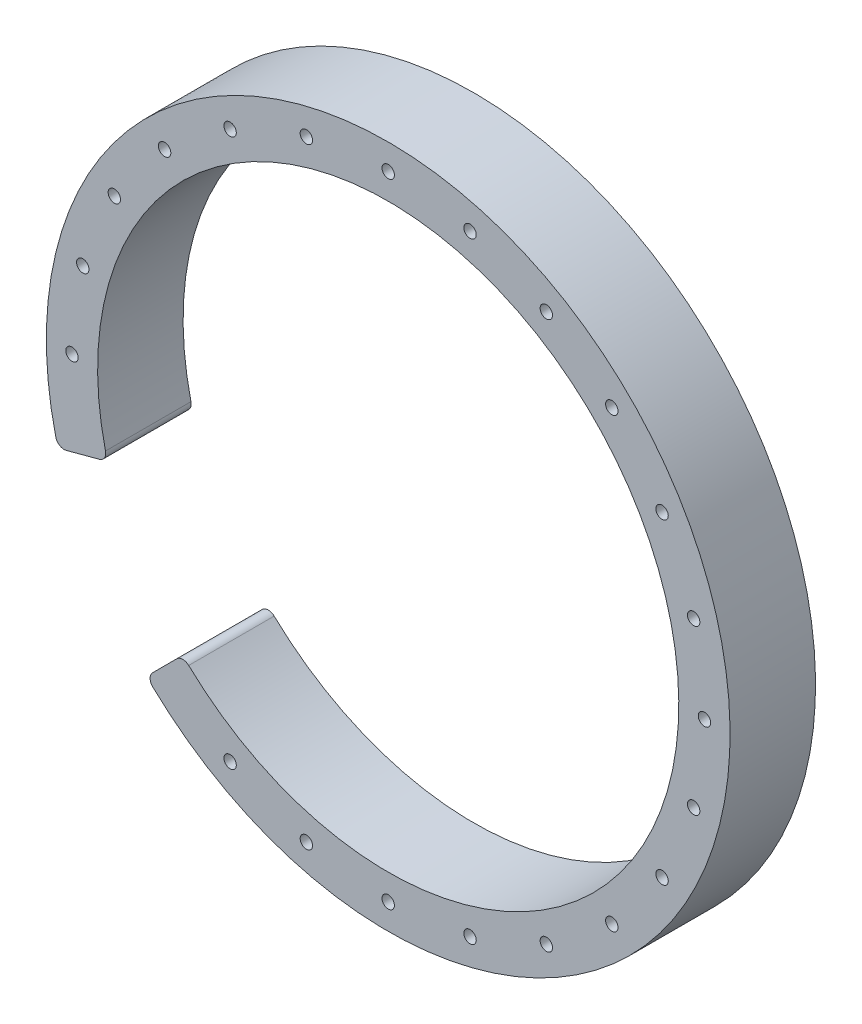
ISO-10303-21;
HEADER;
FILE_DESCRIPTION(('STEP AP214'),'2;1');
FILE_NAME('part.step','',(''),(''),'','','');
FILE_SCHEMA(('AUTOMOTIVE_DESIGN { 1 0 10303 214 1 1 1 1 }'));
ENDSEC;
DATA;
#1=APPLICATION_CONTEXT('core data for automotive mechanical design processes');
#2=APPLICATION_PROTOCOL_DEFINITION('international standard','automotive_design',2000,#1);
#3=PRODUCT_CONTEXT('',#1,'mechanical');
#4=PRODUCT('Part','Part','',(#3));
#5=PRODUCT_RELATED_PRODUCT_CATEGORY('part','',(#4));
#6=PRODUCT_DEFINITION_FORMATION('','',#4);
#7=PRODUCT_DEFINITION_CONTEXT('part definition',#1,'design');
#8=PRODUCT_DEFINITION('design','',#6,#7);
#9=PRODUCT_DEFINITION_SHAPE('','',#8);
#10=(LENGTH_UNIT() NAMED_UNIT(*) SI_UNIT(.MILLI.,.METRE.));
#11=(NAMED_UNIT(*) PLANE_ANGLE_UNIT() SI_UNIT($,.RADIAN.));
#12=(NAMED_UNIT(*) SI_UNIT($,.STERADIAN.) SOLID_ANGLE_UNIT());
#13=UNCERTAINTY_MEASURE_WITH_UNIT(LENGTH_MEASURE(1.E-05),#10,'distance_accuracy_value','');
#14=(GEOMETRIC_REPRESENTATION_CONTEXT(3) GLOBAL_UNCERTAINTY_ASSIGNED_CONTEXT((#13)) GLOBAL_UNIT_ASSIGNED_CONTEXT((#10,
#11,#12)) REPRESENTATION_CONTEXT('',''));
#15=CARTESIAN_POINT('',(0.,0.,0.));
#16=DIRECTION('',(0.,0.,1.));
#17=DIRECTION('',(1.,0.,0.));
#18=AXIS2_PLACEMENT_3D('',#15,#16,#17);
#19=CARTESIAN_POINT('',(-31.1879680337444,-2.03767962998269,20.));
#20=DIRECTION('',(0.,0.,-1.));
#21=DIRECTION('',(-1.,0.,0.));
#22=AXIS2_PLACEMENT_3D('',#19,#20,#21);
#23=PLANE('',#22);
#24=CARTESIAN_POINT('',(116.125624252993,35.3643260960563,20.));
#25=DIRECTION('',(0.,0.,1.));
#26=DIRECTION('',(1.,0.,0.));
#27=AXIS2_PLACEMENT_3D('',#24,#25,#26);
#28=CIRCLE('',#27,1.45000000068002);
#29=CARTESIAN_POINT('',(117.575624253673,35.3643260960563,20.));
#30=VERTEX_POINT('',#29);
#31=EDGE_CURVE('E290',#30,#30,#28,.T.);
#32=ORIENTED_EDGE('',*,*,#31,.F.);
#33=EDGE_LOOP('',(#32));
#34=FACE_BOUND('',#33,.T.);
#35=CARTESIAN_POINT('',(96.9730149154132,68.5376185656963,20.));
#36=DIRECTION('',(0.,0.,1.));
#37=DIRECTION('',(1.,0.,0.));
#38=AXIS2_PLACEMENT_3D('',#35,#36,#37);
#39=CIRCLE('',#38,1.45000000068002);
#40=CARTESIAN_POINT('',(98.4230149160933,68.5376185656963,20.));
#41=VERTEX_POINT('',#40);
#42=EDGE_CURVE('E278',#41,#41,#39,.T.);
#43=ORIENTED_EDGE('',*,*,#42,.F.);
#44=EDGE_LOOP('',(#43));
#45=FACE_BOUND('',#44,.T.);
#46=CARTESIAN_POINT('',(63.7997224432332,87.6902279032763,20.));
#47=DIRECTION('',(0.,0.,1.));
#48=DIRECTION('',(1.,0.,0.));
#49=AXIS2_PLACEMENT_3D('',#46,#47,#48);
#50=CIRCLE('',#49,1.45000000068002);
#51=CARTESIAN_POINT('',(65.2497224439132,87.6902279032763,20.));
#52=VERTEX_POINT('',#51);
#53=EDGE_CURVE('E266',#52,#52,#50,.T.);
#54=ORIENTED_EDGE('',*,*,#53,.F.);
#55=EDGE_LOOP('',(#54));
#56=FACE_BOUND('',#55,.T.);
#57=CARTESIAN_POINT('',(25.4945037680733,87.6902279032763,20.));
#58=DIRECTION('',(0.,0.,1.));
#59=DIRECTION('',(1.,0.,0.));
#60=AXIS2_PLACEMENT_3D('',#57,#58,#59);
#61=CIRCLE('',#60,1.45000000067999);
#62=CARTESIAN_POINT('',(26.9445037687533,87.6902279032763,20.));
#63=VERTEX_POINT('',#62);
#64=EDGE_CURVE('E254',#63,#63,#61,.T.);
#65=ORIENTED_EDGE('',*,*,#64,.F.);
#66=EDGE_LOOP('',(#65));
#67=FACE_BOUND('',#66,.T.);
#68=CARTESIAN_POINT('',(-7.6787887015668,68.5376185656963,20.));
#69=DIRECTION('',(0.,0.,1.));
#70=DIRECTION('',(1.,0.,0.));
#71=AXIS2_PLACEMENT_3D('',#68,#69,#70);
#72=CIRCLE('',#71,1.45000000067999);
#73=CARTESIAN_POINT('',(-6.22878870088681,68.5376185656963,20.));
#74=VERTEX_POINT('',#73);
#75=EDGE_CURVE('E242',#74,#74,#72,.T.);
#76=ORIENTED_EDGE('',*,*,#75,.F.);
#77=EDGE_LOOP('',(#76));
#78=FACE_BOUND('',#77,.T.);
#79=CARTESIAN_POINT('',(25.4945037680733,-55.2667943863237,20.));
#80=DIRECTION('',(0.,0.,1.));
#81=DIRECTION('',(1.,0.,0.));
#82=AXIS2_PLACEMENT_3D('',#79,#80,#81);
#83=CIRCLE('',#82,1.45000000067999);
#84=CARTESIAN_POINT('',(26.9445037687533,-55.2667943863237,20.));
#85=VERTEX_POINT('',#84);
#86=EDGE_CURVE('E230',#85,#85,#83,.T.);
#87=ORIENTED_EDGE('',*,*,#86,.F.);
#88=EDGE_LOOP('',(#87));
#89=FACE_BOUND('',#88,.T.);
#90=CARTESIAN_POINT('',(63.7997224432332,-55.2667943863237,20.));
#91=DIRECTION('',(0.,0.,1.));
#92=DIRECTION('',(1.,0.,0.));
#93=AXIS2_PLACEMENT_3D('',#90,#91,#92);
#94=CIRCLE('',#93,1.45000000068002);
#95=CARTESIAN_POINT('',(65.2497224439132,-55.2667943863237,20.));
#96=VERTEX_POINT('',#95);
#97=EDGE_CURVE('E218',#96,#96,#94,.T.);
#98=ORIENTED_EDGE('',*,*,#97,.F.);
#99=EDGE_LOOP('',(#98));
#100=FACE_BOUND('',#99,.T.);
#101=CARTESIAN_POINT('',(96.9730149154132,-36.1141850487437,20.));
#102=DIRECTION('',(0.,0.,1.));
#103=DIRECTION('',(1.,0.,0.));
#104=AXIS2_PLACEMENT_3D('',#101,#102,#103);
#105=CIRCLE('',#104,1.45000000068002);
#106=CARTESIAN_POINT('',(98.4230149160933,-36.1141850487437,20.));
#107=VERTEX_POINT('',#106);
#108=EDGE_CURVE('E206',#107,#107,#105,.T.);
#109=ORIENTED_EDGE('',*,*,#108,.F.);
#110=EDGE_LOOP('',(#109));
#111=FACE_BOUND('',#110,.T.);
#112=CARTESIAN_POINT('',(116.125624252993,-2.94089257910374,20.));
#113=DIRECTION('',(0.,0.,1.));
#114=DIRECTION('',(1.,0.,0.));
#115=AXIS2_PLACEMENT_3D('',#112,#113,#114);
#116=CIRCLE('',#115,1.45000000068002);
#117=CARTESIAN_POINT('',(117.575624253673,-2.94089257910374,20.));
#118=VERTEX_POINT('',#117);
#119=EDGE_CURVE('E194',#118,#118,#116,.T.);
#120=ORIENTED_EDGE('',*,*,#119,.F.);
#121=EDGE_LOOP('',(#120));
#122=FACE_BOUND('',#121,.T.);
#123=CARTESIAN_POINT('',(-19.4387667741467,53.2117167588363,20.));
#124=DIRECTION('',(0.,0.,1.));
#125=DIRECTION('',(1.,0.,0.));
#126=AXIS2_PLACEMENT_3D('',#123,#124,#125);
#127=CIRCLE('',#126,1.45000000067999);
#128=CARTESIAN_POINT('',(-17.9887667734668,53.2117167588363,20.));
#129=VERTEX_POINT('',#128);
#130=EDGE_CURVE('E182',#129,#129,#127,.T.);
#131=ORIENTED_EDGE('',*,*,#130,.F.);
#132=EDGE_LOOP('',(#131));
#133=FACE_BOUND('',#132,.T.);
#134=CARTESIAN_POINT('',(-31.1879680337444,-2.03767962998269,20.));
#135=DIRECTION('',(0.,0.,1.));
#136=DIRECTION('',(-1.,0.,0.));
#137=AXIS2_PLACEMENT_3D('',#134,#135,#136);
#138=CIRCLE('',#137,1.99999999999999);
#139=CARTESIAN_POINT('',(-33.1324572937491,-2.50561287065525,20.));
#140=VERTEX_POINT('',#139);
#141=CARTESIAN_POINT('',(-30.6703299435971,-3.9695312825763,20.));
#142=VERTEX_POINT('',#141);
#143=EDGE_CURVE('E145',#140,#142,#138,.T.);
#144=ORIENTED_EDGE('',*,*,#143,.T.);
#145=DIRECTION('',(0.965925826296804,0.258819045073653,0.));
#146=VECTOR('',#145,1.);
#147=CARTESIAN_POINT('',(-26.8313980391468,-2.94089257910374,20.));
#148=LINE('',#147,#146);
#149=CARTESIAN_POINT('',(-22.9400912190645,-1.89822005928562,20.));
#150=VERTEX_POINT('',#149);
#151=EDGE_CURVE('E93',#142,#150,#148,.T.);
#152=ORIENTED_EDGE('',*,*,#151,.T.);
#153=CARTESIAN_POINT('',(-23.4577293092118,0.0336315933079888,20.));
#154=DIRECTION('',(0.,0.,1.));
#155=DIRECTION('',(-1.,0.,0.));
#156=AXIS2_PLACEMENT_3D('',#153,#154,#155);
#157=CIRCLE('',#156,2.);
#158=CARTESIAN_POINT('',(-21.5118766687646,0.495862597963348,20.));
#159=VERTEX_POINT('',#158);
#160=EDGE_CURVE('E160',#150,#159,#157,.T.);
#161=ORIENTED_EDGE('',*,*,#160,.T.);
#162=CARTESIAN_POINT('',(44.6471131064398,16.2117167562456,20.));
#163=DIRECTION('',(0.,0.,-1.));
#164=DIRECTION('',(1.,0.,0.));
#165=AXIS2_PLACEMENT_3D('',#162,#163,#164);
#166=CIRCLE('',#165,68.);
#167=CARTESIAN_POINT('',(-2.04271072588365,-33.2257219972599,20.));
#168=VERTEX_POINT('',#167);
#169=EDGE_CURVE('E173',#159,#168,#166,.T.);
#170=ORIENTED_EDGE('',*,*,#169,.T.);
#171=CARTESIAN_POINT('',(-3.41594083859904,-34.6797643135394,20.));
#172=DIRECTION('',(0.,0.,1.));
#173=DIRECTION('',(1.,0.,0.));
#174=AXIS2_PLACEMENT_3D('',#171,#172,#173);
#175=CIRCLE('',#174,2.);
#176=CARTESIAN_POINT('',(-4.83015440097213,-33.2655507511663,20.));
#177=VERTEX_POINT('',#176);
#178=EDGE_CURVE('E112',#168,#177,#175,.T.);
#179=ORIENTED_EDGE('',*,*,#178,.T.);
#180=DIRECTION('',(-0.707106781186548,-0.707106781186547,0.));
#181=VECTOR('',#180,1.);
#182=CARTESIAN_POINT('',(-4.83015440097213,-33.2655507511663,20.));
#183=LINE('',#182,#181);
#184=CARTESIAN_POINT('',(-10.4890819019211,-38.9244782521153,20.));
#185=VERTEX_POINT('',#184);
#186=EDGE_CURVE('E106',#177,#185,#183,.T.);
#187=ORIENTED_EDGE('',*,*,#186,.T.);
#188=CARTESIAN_POINT('',(-9.07486833954801,-40.3386918144884,20.));
#189=DIRECTION('',(0.,0.,1.));
#190=DIRECTION('',(1.,0.,0.));
#191=AXIS2_PLACEMENT_3D('',#188,#189,#190);
#192=CIRCLE('',#191,2.00000000000001);
#193=CARTESIAN_POINT('',(-10.4523550432913,-41.7887022906611,20.));
#194=VERTEX_POINT('',#193);
#195=EDGE_CURVE('E110',#185,#194,#192,.T.);
#196=ORIENTED_EDGE('',*,*,#195,.T.);
#197=CARTESIAN_POINT('',(44.6471131064398,16.2117167562456,20.));
#198=DIRECTION('',(0.,0.,1.));
#199=DIRECTION('',(1.,0.,0.));
#200=AXIS2_PLACEMENT_3D('',#197,#198,#199);
#201=CIRCLE('',#200,80.);
#202=EDGE_CURVE('E50',#194,#140,#201,.T.);
#203=ORIENTED_EDGE('',*,*,#202,.T.);
#204=EDGE_LOOP('',(#144,#152,#161,#170,#179,#187,#196,#203));
#205=FACE_BOUND('',#204,.T.);
#206=CARTESIAN_POINT('',(-26.8313980391468,35.3643260960563,20.));
#207=DIRECTION('',(0.,0.,1.));
#208=DIRECTION('',(1.,0.,0.));
#209=AXIS2_PLACEMENT_3D('',#206,#207,#208);
#210=CIRCLE('',#209,1.45000000067999);
#211=CARTESIAN_POINT('',(-25.3813980384668,35.3643260960563,20.));
#212=VERTEX_POINT('',#211);
#213=EDGE_CURVE('E133',#212,#212,#210,.T.);
#214=ORIENTED_EDGE('',*,*,#213,.F.);
#215=EDGE_LOOP('',(#214));
#216=FACE_BOUND('',#215,.T.);
#217=CARTESIAN_POINT('',(-29.3528868925267,16.2117167584763,20.));
#218=DIRECTION('',(0.,0.,1.));
#219=DIRECTION('',(1.,0.,0.));
#220=AXIS2_PLACEMENT_3D('',#217,#218,#219);
#221=CIRCLE('',#220,1.45000000067999);
#222=CARTESIAN_POINT('',(-27.9028868918468,16.2117167584763,20.));
#223=VERTEX_POINT('',#222);
#224=EDGE_CURVE('E188',#223,#223,#221,.T.);
#225=ORIENTED_EDGE('',*,*,#224,.F.);
#226=EDGE_LOOP('',(#225));
#227=FACE_BOUND('',#226,.T.);
#228=CARTESIAN_POINT('',(108.732992987993,-20.7882832418837,20.));
#229=DIRECTION('',(0.,0.,1.));
#230=DIRECTION('',(1.,0.,0.));
#231=AXIS2_PLACEMENT_3D('',#228,#229,#230);
#232=CIRCLE('',#231,1.45000000068002);
#233=CARTESIAN_POINT('',(110.182992988673,-20.7882832418837,20.));
#234=VERTEX_POINT('',#233);
#235=EDGE_CURVE('E200',#234,#234,#232,.T.);
#236=ORIENTED_EDGE('',*,*,#235,.F.);
#237=EDGE_LOOP('',(#236));
#238=FACE_BOUND('',#237,.T.);
#239=CARTESIAN_POINT('',(81.6471131060132,-47.8741631213237,20.));
#240=DIRECTION('',(0.,0.,1.));
#241=DIRECTION('',(1.,0.,0.));
#242=AXIS2_PLACEMENT_3D('',#239,#240,#241);
#243=CIRCLE('',#242,1.45000000068002);
#244=CARTESIAN_POINT('',(83.0971131066932,-47.8741631213237,20.));
#245=VERTEX_POINT('',#244);
#246=EDGE_CURVE('E212',#245,#245,#243,.T.);
#247=ORIENTED_EDGE('',*,*,#246,.F.);
#248=EDGE_LOOP('',(#247));
#249=FACE_BOUND('',#248,.T.);
#250=CARTESIAN_POINT('',(44.6471131056532,-57.7882832422437,20.));
#251=DIRECTION('',(0.,0.,1.));
#252=DIRECTION('',(1.,0.,0.));
#253=AXIS2_PLACEMENT_3D('',#250,#251,#252);
#254=CIRCLE('',#253,1.45000000068002);
#255=CARTESIAN_POINT('',(46.0971131063332,-57.7882832422437,20.));
#256=VERTEX_POINT('',#255);
#257=EDGE_CURVE('E224',#256,#256,#254,.T.);
#258=ORIENTED_EDGE('',*,*,#257,.F.);
#259=EDGE_LOOP('',(#258));
#260=FACE_BOUND('',#259,.T.);
#261=CARTESIAN_POINT('',(7.6471131078332,-47.8741631213237,20.));
#262=DIRECTION('',(0.,0.,1.));
#263=DIRECTION('',(1.,0.,0.));
#264=AXIS2_PLACEMENT_3D('',#261,#262,#263);
#265=CIRCLE('',#264,1.45000000067999);
#266=CARTESIAN_POINT('',(9.09711310851319,-47.8741631213237,20.));
#267=VERTEX_POINT('',#266);
#268=EDGE_CURVE('E236',#267,#267,#265,.T.);
#269=ORIENTED_EDGE('',*,*,#268,.F.);
#270=EDGE_LOOP('',(#269));
#271=FACE_BOUND('',#270,.T.);
#272=CARTESIAN_POINT('',(7.6471131078332,80.2975966382763,20.));
#273=DIRECTION('',(0.,0.,1.));
#274=DIRECTION('',(1.,0.,0.));
#275=AXIS2_PLACEMENT_3D('',#272,#273,#274);
#276=CIRCLE('',#275,1.45000000067999);
#277=CARTESIAN_POINT('',(9.09711310851319,80.2975966382763,20.));
#278=VERTEX_POINT('',#277);
#279=EDGE_CURVE('E248',#278,#278,#276,.T.);
#280=ORIENTED_EDGE('',*,*,#279,.F.);
#281=EDGE_LOOP('',(#280));
#282=FACE_BOUND('',#281,.T.);
#283=CARTESIAN_POINT('',(44.6471131056532,90.2117167591962,20.));
#284=DIRECTION('',(0.,0.,1.));
#285=DIRECTION('',(1.,0.,0.));
#286=AXIS2_PLACEMENT_3D('',#283,#284,#285);
#287=CIRCLE('',#286,1.45000000068002);
#288=CARTESIAN_POINT('',(46.0971131063332,90.2117167591962,20.));
#289=VERTEX_POINT('',#288);
#290=EDGE_CURVE('E260',#289,#289,#287,.T.);
#291=ORIENTED_EDGE('',*,*,#290,.F.);
#292=EDGE_LOOP('',(#291));
#293=FACE_BOUND('',#292,.T.);
#294=CARTESIAN_POINT('',(81.6471131060132,80.2975966382763,20.));
#295=DIRECTION('',(0.,0.,1.));
#296=DIRECTION('',(1.,0.,0.));
#297=AXIS2_PLACEMENT_3D('',#294,#295,#296);
#298=CIRCLE('',#297,1.45000000068002);
#299=CARTESIAN_POINT('',(83.0971131066932,80.2975966382763,20.));
#300=VERTEX_POINT('',#299);
#301=EDGE_CURVE('E272',#300,#300,#298,.T.);
#302=ORIENTED_EDGE('',*,*,#301,.F.);
#303=EDGE_LOOP('',(#302));
#304=FACE_BOUND('',#303,.T.);
#305=CARTESIAN_POINT('',(108.732992987993,53.2117167588363,20.));
#306=DIRECTION('',(0.,0.,1.));
#307=DIRECTION('',(1.,0.,0.));
#308=AXIS2_PLACEMENT_3D('',#305,#306,#307);
#309=CIRCLE('',#308,1.45000000068002);
#310=CARTESIAN_POINT('',(110.182992988673,53.2117167588363,20.));
#311=VERTEX_POINT('',#310);
#312=EDGE_CURVE('E284',#311,#311,#309,.T.);
#313=ORIENTED_EDGE('',*,*,#312,.F.);
#314=EDGE_LOOP('',(#313));
#315=FACE_BOUND('',#314,.T.);
#316=CARTESIAN_POINT('',(118.647113103833,16.2117167584763,20.));
#317=DIRECTION('',(0.,0.,1.));
#318=DIRECTION('',(1.,0.,0.));
#319=AXIS2_PLACEMENT_3D('',#316,#317,#318);
#320=CIRCLE('',#319,1.45000000067996);
#321=CARTESIAN_POINT('',(120.097113104513,16.2117167584763,20.));
#322=VERTEX_POINT('',#321);
#323=EDGE_CURVE('E296',#322,#322,#320,.T.);
#324=ORIENTED_EDGE('',*,*,#323,.F.);
#325=EDGE_LOOP('',(#324));
#326=FACE_BOUND('',#325,.T.);
#327=ADVANCED_FACE('F33',(#34,#45,#56,#67,#78,#89,#100,#111,#122,#133,#205,#216,#227,#238,#249,
#260,#271,#282,#293,#304,#315,#326),#23,.F.);
#328=CARTESIAN_POINT('',(-31.1879680337444,-2.03767962998269,0.));
#329=DIRECTION('',(0.,0.,-1.));
#330=DIRECTION('',(-1.,0.,0.));
#331=AXIS2_PLACEMENT_3D('',#328,#329,#330);
#332=PLANE('',#331);
#333=CARTESIAN_POINT('',(116.125624252993,35.3643260960563,0.));
#334=DIRECTION('',(0.,0.,1.));
#335=DIRECTION('',(1.,0.,0.));
#336=AXIS2_PLACEMENT_3D('',#333,#334,#335);
#337=CIRCLE('',#336,1.45000000068002);
#338=CARTESIAN_POINT('',(117.575624253673,35.3643260960563,0.));
#339=VERTEX_POINT('',#338);
#340=EDGE_CURVE('E293',#339,#339,#337,.T.);
#341=ORIENTED_EDGE('',*,*,#340,.T.);
#342=EDGE_LOOP('',(#341));
#343=FACE_BOUND('',#342,.T.);
#344=CARTESIAN_POINT('',(96.9730149154132,68.5376185656963,0.));
#345=DIRECTION('',(0.,0.,1.));
#346=DIRECTION('',(1.,0.,0.));
#347=AXIS2_PLACEMENT_3D('',#344,#345,#346);
#348=CIRCLE('',#347,1.45000000068002);
#349=CARTESIAN_POINT('',(98.4230149160933,68.5376185656963,0.));
#350=VERTEX_POINT('',#349);
#351=EDGE_CURVE('E281',#350,#350,#348,.T.);
#352=ORIENTED_EDGE('',*,*,#351,.T.);
#353=EDGE_LOOP('',(#352));
#354=FACE_BOUND('',#353,.T.);
#355=CARTESIAN_POINT('',(63.7997224432332,87.6902279032763,0.));
#356=DIRECTION('',(0.,0.,1.));
#357=DIRECTION('',(1.,0.,0.));
#358=AXIS2_PLACEMENT_3D('',#355,#356,#357);
#359=CIRCLE('',#358,1.45000000068002);
#360=CARTESIAN_POINT('',(65.2497224439132,87.6902279032763,0.));
#361=VERTEX_POINT('',#360);
#362=EDGE_CURVE('E269',#361,#361,#359,.T.);
#363=ORIENTED_EDGE('',*,*,#362,.T.);
#364=EDGE_LOOP('',(#363));
#365=FACE_BOUND('',#364,.T.);
#366=CARTESIAN_POINT('',(25.4945037680733,87.6902279032763,0.));
#367=DIRECTION('',(0.,0.,1.));
#368=DIRECTION('',(1.,0.,0.));
#369=AXIS2_PLACEMENT_3D('',#366,#367,#368);
#370=CIRCLE('',#369,1.45000000067999);
#371=CARTESIAN_POINT('',(26.9445037687533,87.6902279032763,0.));
#372=VERTEX_POINT('',#371);
#373=EDGE_CURVE('E257',#372,#372,#370,.T.);
#374=ORIENTED_EDGE('',*,*,#373,.T.);
#375=EDGE_LOOP('',(#374));
#376=FACE_BOUND('',#375,.T.);
#377=CARTESIAN_POINT('',(-7.6787887015668,68.5376185656963,0.));
#378=DIRECTION('',(0.,0.,1.));
#379=DIRECTION('',(1.,0.,0.));
#380=AXIS2_PLACEMENT_3D('',#377,#378,#379);
#381=CIRCLE('',#380,1.45000000067999);
#382=CARTESIAN_POINT('',(-6.22878870088681,68.5376185656963,0.));
#383=VERTEX_POINT('',#382);
#384=EDGE_CURVE('E245',#383,#383,#381,.T.);
#385=ORIENTED_EDGE('',*,*,#384,.T.);
#386=EDGE_LOOP('',(#385));
#387=FACE_BOUND('',#386,.T.);
#388=CARTESIAN_POINT('',(25.4945037680733,-55.2667943863237,0.));
#389=DIRECTION('',(0.,0.,1.));
#390=DIRECTION('',(1.,0.,0.));
#391=AXIS2_PLACEMENT_3D('',#388,#389,#390);
#392=CIRCLE('',#391,1.45000000067999);
#393=CARTESIAN_POINT('',(26.9445037687533,-55.2667943863237,0.));
#394=VERTEX_POINT('',#393);
#395=EDGE_CURVE('E233',#394,#394,#392,.T.);
#396=ORIENTED_EDGE('',*,*,#395,.T.);
#397=EDGE_LOOP('',(#396));
#398=FACE_BOUND('',#397,.T.);
#399=CARTESIAN_POINT('',(63.7997224432332,-55.2667943863237,0.));
#400=DIRECTION('',(0.,0.,1.));
#401=DIRECTION('',(1.,0.,0.));
#402=AXIS2_PLACEMENT_3D('',#399,#400,#401);
#403=CIRCLE('',#402,1.45000000068002);
#404=CARTESIAN_POINT('',(65.2497224439132,-55.2667943863237,0.));
#405=VERTEX_POINT('',#404);
#406=EDGE_CURVE('E221',#405,#405,#403,.T.);
#407=ORIENTED_EDGE('',*,*,#406,.T.);
#408=EDGE_LOOP('',(#407));
#409=FACE_BOUND('',#408,.T.);
#410=CARTESIAN_POINT('',(96.9730149154132,-36.1141850487437,0.));
#411=DIRECTION('',(0.,0.,1.));
#412=DIRECTION('',(1.,0.,0.));
#413=AXIS2_PLACEMENT_3D('',#410,#411,#412);
#414=CIRCLE('',#413,1.45000000068002);
#415=CARTESIAN_POINT('',(98.4230149160933,-36.1141850487437,0.));
#416=VERTEX_POINT('',#415);
#417=EDGE_CURVE('E209',#416,#416,#414,.T.);
#418=ORIENTED_EDGE('',*,*,#417,.T.);
#419=EDGE_LOOP('',(#418));
#420=FACE_BOUND('',#419,.T.);
#421=CARTESIAN_POINT('',(116.125624252993,-2.94089257910374,0.));
#422=DIRECTION('',(0.,0.,1.));
#423=DIRECTION('',(1.,0.,0.));
#424=AXIS2_PLACEMENT_3D('',#421,#422,#423);
#425=CIRCLE('',#424,1.45000000068002);
#426=CARTESIAN_POINT('',(117.575624253673,-2.94089257910374,0.));
#427=VERTEX_POINT('',#426);
#428=EDGE_CURVE('E197',#427,#427,#425,.T.);
#429=ORIENTED_EDGE('',*,*,#428,.T.);
#430=EDGE_LOOP('',(#429));
#431=FACE_BOUND('',#430,.T.);
#432=CARTESIAN_POINT('',(-19.4387667741467,53.2117167588363,0.));
#433=DIRECTION('',(0.,0.,1.));
#434=DIRECTION('',(1.,0.,0.));
#435=AXIS2_PLACEMENT_3D('',#432,#433,#434);
#436=CIRCLE('',#435,1.45000000067999);
#437=CARTESIAN_POINT('',(-17.9887667734668,53.2117167588363,0.));
#438=VERTEX_POINT('',#437);
#439=EDGE_CURVE('E185',#438,#438,#436,.T.);
#440=ORIENTED_EDGE('',*,*,#439,.T.);
#441=EDGE_LOOP('',(#440));
#442=FACE_BOUND('',#441,.T.);
#443=CARTESIAN_POINT('',(-31.1879680337444,-2.03767962998269,0.));
#444=DIRECTION('',(0.,0.,1.));
#445=DIRECTION('',(-1.,0.,0.));
#446=AXIS2_PLACEMENT_3D('',#443,#444,#445);
#447=CIRCLE('',#446,1.99999999999999);
#448=CARTESIAN_POINT('',(-33.1324572937491,-2.50561287065525,0.));
#449=VERTEX_POINT('',#448);
#450=CARTESIAN_POINT('',(-30.6703299435971,-3.9695312825763,0.));
#451=VERTEX_POINT('',#450);
#452=EDGE_CURVE('E129',#449,#451,#447,.T.);
#453=ORIENTED_EDGE('',*,*,#452,.F.);
#454=CARTESIAN_POINT('',(44.6471131064398,16.2117167562456,0.));
#455=DIRECTION('',(0.,0.,1.));
#456=DIRECTION('',(1.,0.,0.));
#457=AXIS2_PLACEMENT_3D('',#454,#455,#456);
#458=CIRCLE('',#457,80.);
#459=CARTESIAN_POINT('',(-10.4523550432913,-41.7887022906611,0.));
#460=VERTEX_POINT('',#459);
#461=EDGE_CURVE('E85',#460,#449,#458,.T.);
#462=ORIENTED_EDGE('',*,*,#461,.F.);
#463=CARTESIAN_POINT('',(-9.07486833954801,-40.3386918144884,0.));
#464=DIRECTION('',(0.,0.,1.));
#465=DIRECTION('',(1.,0.,0.));
#466=AXIS2_PLACEMENT_3D('',#463,#464,#465);
#467=CIRCLE('',#466,2.00000000000001);
#468=CARTESIAN_POINT('',(-10.4890819019211,-38.9244782521153,0.));
#469=VERTEX_POINT('',#468);
#470=EDGE_CURVE('E79',#469,#460,#467,.T.);
#471=ORIENTED_EDGE('',*,*,#470,.F.);
#472=DIRECTION('',(-0.707106781186548,-0.707106781186547,0.));
#473=VECTOR('',#472,1.);
#474=CARTESIAN_POINT('',(-7.67878870005817,-36.1141850502524,0.));
#475=LINE('',#474,#473);
#476=CARTESIAN_POINT('',(-4.83015440097213,-33.2655507511663,0.));
#477=VERTEX_POINT('',#476);
#478=EDGE_CURVE('E119',#477,#469,#475,.T.);
#479=ORIENTED_EDGE('',*,*,#478,.F.);
#480=CARTESIAN_POINT('',(-3.41594083859904,-34.6797643135394,0.));
#481=DIRECTION('',(0.,0.,1.));
#482=DIRECTION('',(1.,0.,0.));
#483=AXIS2_PLACEMENT_3D('',#480,#481,#482);
#484=CIRCLE('',#483,2.);
#485=CARTESIAN_POINT('',(-2.04271072588365,-33.2257219972599,0.));
#486=VERTEX_POINT('',#485);
#487=EDGE_CURVE('E139',#486,#477,#484,.T.);
#488=ORIENTED_EDGE('',*,*,#487,.F.);
#489=CARTESIAN_POINT('',(44.6471131064398,16.2117167562456,0.));
#490=DIRECTION('',(0.,0.,-1.));
#491=DIRECTION('',(1.,0.,0.));
#492=AXIS2_PLACEMENT_3D('',#489,#490,#491);
#493=CIRCLE('',#492,68.);
#494=CARTESIAN_POINT('',(-21.5118766687646,0.495862597963348,0.));
#495=VERTEX_POINT('',#494);
#496=EDGE_CURVE('E137',#495,#486,#493,.T.);
#497=ORIENTED_EDGE('',*,*,#496,.F.);
#498=CARTESIAN_POINT('',(-23.4577293092118,0.0336315933079888,0.));
#499=DIRECTION('',(0.,0.,1.));
#500=DIRECTION('',(-1.,0.,0.));
#501=AXIS2_PLACEMENT_3D('',#498,#499,#500);
#502=CIRCLE('',#501,2.);
#503=CARTESIAN_POINT('',(-22.9400912190645,-1.89822005928562,0.));
#504=VERTEX_POINT('',#503);
#505=EDGE_CURVE('E135',#504,#495,#502,.T.);
#506=ORIENTED_EDGE('',*,*,#505,.F.);
#507=DIRECTION('',(0.965925826296804,0.258819045073653,0.));
#508=VECTOR('',#507,1.);
#509=CARTESIAN_POINT('',(-22.9400912190645,-1.89822005928562,0.));
#510=LINE('',#509,#508);
#511=EDGE_CURVE('E132',#451,#504,#510,.T.);
#512=ORIENTED_EDGE('',*,*,#511,.F.);
#513=EDGE_LOOP('',(#453,#462,#471,#479,#488,#497,#506,#512));
#514=FACE_BOUND('',#513,.T.);
#515=CARTESIAN_POINT('',(-26.8313980391468,35.3643260960563,0.));
#516=DIRECTION('',(0.,0.,1.));
#517=DIRECTION('',(1.,0.,0.));
#518=AXIS2_PLACEMENT_3D('',#515,#516,#517);
#519=CIRCLE('',#518,1.45000000067999);
#520=CARTESIAN_POINT('',(-25.3813980384668,35.3643260960563,0.));
#521=VERTEX_POINT('',#520);
#522=EDGE_CURVE('E179',#521,#521,#519,.T.);
#523=ORIENTED_EDGE('',*,*,#522,.T.);
#524=EDGE_LOOP('',(#523));
#525=FACE_BOUND('',#524,.T.);
#526=CARTESIAN_POINT('',(-29.3528868925267,16.2117167584763,0.));
#527=DIRECTION('',(0.,0.,1.));
#528=DIRECTION('',(1.,0.,0.));
#529=AXIS2_PLACEMENT_3D('',#526,#527,#528);
#530=CIRCLE('',#529,1.45000000067999);
#531=CARTESIAN_POINT('',(-27.9028868918468,16.2117167584763,0.));
#532=VERTEX_POINT('',#531);
#533=EDGE_CURVE('E191',#532,#532,#530,.T.);
#534=ORIENTED_EDGE('',*,*,#533,.T.);
#535=EDGE_LOOP('',(#534));
#536=FACE_BOUND('',#535,.T.);
#537=CARTESIAN_POINT('',(108.732992987993,-20.7882832418837,0.));
#538=DIRECTION('',(0.,0.,1.));
#539=DIRECTION('',(1.,0.,0.));
#540=AXIS2_PLACEMENT_3D('',#537,#538,#539);
#541=CIRCLE('',#540,1.45000000068002);
#542=CARTESIAN_POINT('',(110.182992988673,-20.7882832418837,0.));
#543=VERTEX_POINT('',#542);
#544=EDGE_CURVE('E203',#543,#543,#541,.T.);
#545=ORIENTED_EDGE('',*,*,#544,.T.);
#546=EDGE_LOOP('',(#545));
#547=FACE_BOUND('',#546,.T.);
#548=CARTESIAN_POINT('',(81.6471131060132,-47.8741631213237,0.));
#549=DIRECTION('',(0.,0.,1.));
#550=DIRECTION('',(1.,0.,0.));
#551=AXIS2_PLACEMENT_3D('',#548,#549,#550);
#552=CIRCLE('',#551,1.45000000068002);
#553=CARTESIAN_POINT('',(83.0971131066932,-47.8741631213237,0.));
#554=VERTEX_POINT('',#553);
#555=EDGE_CURVE('E215',#554,#554,#552,.T.);
#556=ORIENTED_EDGE('',*,*,#555,.T.);
#557=EDGE_LOOP('',(#556));
#558=FACE_BOUND('',#557,.T.);
#559=CARTESIAN_POINT('',(44.6471131056532,-57.7882832422437,0.));
#560=DIRECTION('',(0.,0.,1.));
#561=DIRECTION('',(1.,0.,0.));
#562=AXIS2_PLACEMENT_3D('',#559,#560,#561);
#563=CIRCLE('',#562,1.45000000068002);
#564=CARTESIAN_POINT('',(46.0971131063332,-57.7882832422437,0.));
#565=VERTEX_POINT('',#564);
#566=EDGE_CURVE('E227',#565,#565,#563,.T.);
#567=ORIENTED_EDGE('',*,*,#566,.T.);
#568=EDGE_LOOP('',(#567));
#569=FACE_BOUND('',#568,.T.);
#570=CARTESIAN_POINT('',(7.6471131078332,-47.8741631213237,0.));
#571=DIRECTION('',(0.,0.,1.));
#572=DIRECTION('',(1.,0.,0.));
#573=AXIS2_PLACEMENT_3D('',#570,#571,#572);
#574=CIRCLE('',#573,1.45000000067999);
#575=CARTESIAN_POINT('',(9.09711310851319,-47.8741631213237,0.));
#576=VERTEX_POINT('',#575);
#577=EDGE_CURVE('E239',#576,#576,#574,.T.);
#578=ORIENTED_EDGE('',*,*,#577,.T.);
#579=EDGE_LOOP('',(#578));
#580=FACE_BOUND('',#579,.T.);
#581=CARTESIAN_POINT('',(7.6471131078332,80.2975966382763,0.));
#582=DIRECTION('',(0.,0.,1.));
#583=DIRECTION('',(1.,0.,0.));
#584=AXIS2_PLACEMENT_3D('',#581,#582,#583);
#585=CIRCLE('',#584,1.45000000067999);
#586=CARTESIAN_POINT('',(9.09711310851319,80.2975966382763,0.));
#587=VERTEX_POINT('',#586);
#588=EDGE_CURVE('E251',#587,#587,#585,.T.);
#589=ORIENTED_EDGE('',*,*,#588,.T.);
#590=EDGE_LOOP('',(#589));
#591=FACE_BOUND('',#590,.T.);
#592=CARTESIAN_POINT('',(44.6471131056532,90.2117167591962,0.));
#593=DIRECTION('',(0.,0.,1.));
#594=DIRECTION('',(1.,0.,0.));
#595=AXIS2_PLACEMENT_3D('',#592,#593,#594);
#596=CIRCLE('',#595,1.45000000068002);
#597=CARTESIAN_POINT('',(46.0971131063332,90.2117167591962,0.));
#598=VERTEX_POINT('',#597);
#599=EDGE_CURVE('E263',#598,#598,#596,.T.);
#600=ORIENTED_EDGE('',*,*,#599,.T.);
#601=EDGE_LOOP('',(#600));
#602=FACE_BOUND('',#601,.T.);
#603=CARTESIAN_POINT('',(81.6471131060132,80.2975966382763,0.));
#604=DIRECTION('',(0.,0.,1.));
#605=DIRECTION('',(1.,0.,0.));
#606=AXIS2_PLACEMENT_3D('',#603,#604,#605);
#607=CIRCLE('',#606,1.45000000068002);
#608=CARTESIAN_POINT('',(83.0971131066932,80.2975966382763,0.));
#609=VERTEX_POINT('',#608);
#610=EDGE_CURVE('E275',#609,#609,#607,.T.);
#611=ORIENTED_EDGE('',*,*,#610,.T.);
#612=EDGE_LOOP('',(#611));
#613=FACE_BOUND('',#612,.T.);
#614=CARTESIAN_POINT('',(108.732992987993,53.2117167588363,0.));
#615=DIRECTION('',(0.,0.,1.));
#616=DIRECTION('',(1.,0.,0.));
#617=AXIS2_PLACEMENT_3D('',#614,#615,#616);
#618=CIRCLE('',#617,1.45000000068002);
#619=CARTESIAN_POINT('',(110.182992988673,53.2117167588363,0.));
#620=VERTEX_POINT('',#619);
#621=EDGE_CURVE('E287',#620,#620,#618,.T.);
#622=ORIENTED_EDGE('',*,*,#621,.T.);
#623=EDGE_LOOP('',(#622));
#624=FACE_BOUND('',#623,.T.);
#625=CARTESIAN_POINT('',(118.647113103833,16.2117167584763,0.));
#626=DIRECTION('',(0.,0.,1.));
#627=DIRECTION('',(1.,0.,0.));
#628=AXIS2_PLACEMENT_3D('',#625,#626,#627);
#629=CIRCLE('',#628,1.45000000067996);
#630=CARTESIAN_POINT('',(120.097113104513,16.2117167584763,0.));
#631=VERTEX_POINT('',#630);
#632=EDGE_CURVE('E299',#631,#631,#629,.T.);
#633=ORIENTED_EDGE('',*,*,#632,.T.);
#634=EDGE_LOOP('',(#633));
#635=FACE_BOUND('',#634,.T.);
#636=ADVANCED_FACE('F164',(#343,#354,#365,#376,#387,#398,#409,#420,#431,#442,#514,#525,#536,
#547,#558,#569,#580,#591,#602,#613,#624,#635),#332,.T.);
#637=CARTESIAN_POINT('',(-31.1879680337444,-2.03767962998269,20.));
#638=DIRECTION('',(0.,0.,-1.));
#639=DIRECTION('',(-1.,0.,0.));
#640=AXIS2_PLACEMENT_3D('',#637,#638,#639);
#641=CYLINDRICAL_SURFACE('',#640,1.99999999999999);
#642=ORIENTED_EDGE('',*,*,#452,.T.);
#643=DIRECTION('',(0.,0.,-1.));
#644=VECTOR('',#643,1.);
#645=CARTESIAN_POINT('',(-30.6703299435971,-3.9695312825763,20.));
#646=LINE('',#645,#644);
#647=EDGE_CURVE('E11',#142,#451,#646,.T.);
#648=ORIENTED_EDGE('',*,*,#647,.F.);
#649=ORIENTED_EDGE('',*,*,#143,.F.);
#650=DIRECTION('',(0.,0.,-1.));
#651=VECTOR('',#650,1.);
#652=CARTESIAN_POINT('',(-33.1324572937491,-2.50561287065525,20.));
#653=LINE('',#652,#651);
#654=EDGE_CURVE('E125',#140,#449,#653,.T.);
#655=ORIENTED_EDGE('',*,*,#654,.T.);
#656=EDGE_LOOP('',(#642,#648,#649,#655));
#657=FACE_BOUND('',#656,.T.);
#658=ADVANCED_FACE('F35',(#657),#641,.T.);
#659=CARTESIAN_POINT('',(-22.9400912190645,-1.89822005928562,20.));
#660=DIRECTION('',(-0.258819045073653,0.965925826296804,0.));
#661=DIRECTION('',(-0.965925826296804,-0.258819045073653,0.));
#662=AXIS2_PLACEMENT_3D('',#659,#660,#661);
#663=PLANE('',#662);
#664=ORIENTED_EDGE('',*,*,#511,.T.);
#665=DIRECTION('',(0.,0.,-1.));
#666=VECTOR('',#665,1.);
#667=CARTESIAN_POINT('',(-22.9400912190645,-1.89822005928562,20.));
#668=LINE('',#667,#666);
#669=EDGE_CURVE('E42',#150,#504,#668,.T.);
#670=ORIENTED_EDGE('',*,*,#669,.F.);
#671=ORIENTED_EDGE('',*,*,#151,.F.);
#672=ORIENTED_EDGE('',*,*,#647,.T.);
#673=EDGE_LOOP('',(#664,#670,#671,#672));
#674=FACE_BOUND('',#673,.T.);
#675=ADVANCED_FACE('F334',(#674),#663,.F.);
#676=CARTESIAN_POINT('',(-23.4577293092118,0.0336315933079888,20.));
#677=DIRECTION('',(0.,0.,-1.));
#678=DIRECTION('',(-1.,0.,0.));
#679=AXIS2_PLACEMENT_3D('',#676,#677,#678);
#680=CYLINDRICAL_SURFACE('',#679,2.);
#681=ORIENTED_EDGE('',*,*,#505,.T.);
#682=DIRECTION('',(0.,0.,-1.));
#683=VECTOR('',#682,1.);
#684=CARTESIAN_POINT('',(-21.5118766687646,0.495862597963348,20.));
#685=LINE('',#684,#683);
#686=EDGE_CURVE('E152',#159,#495,#685,.T.);
#687=ORIENTED_EDGE('',*,*,#686,.F.);
#688=ORIENTED_EDGE('',*,*,#160,.F.);
#689=ORIENTED_EDGE('',*,*,#669,.T.);
#690=EDGE_LOOP('',(#681,#687,#688,#689));
#691=FACE_BOUND('',#690,.T.);
#692=ADVANCED_FACE('F158',(#691),#680,.T.);
#693=CARTESIAN_POINT('',(44.6471131064398,16.2117167562456,20.));
#694=DIRECTION('',(0.,0.,-1.));
#695=DIRECTION('',(-1.,0.,0.));
#696=AXIS2_PLACEMENT_3D('',#693,#694,#695);
#697=CYLINDRICAL_SURFACE('',#696,68.);
#698=ORIENTED_EDGE('',*,*,#496,.T.);
#699=DIRECTION('',(0.,0.,-1.));
#700=VECTOR('',#699,1.);
#701=CARTESIAN_POINT('',(-2.04271072588365,-33.2257219972599,20.));
#702=LINE('',#701,#700);
#703=EDGE_CURVE('E149',#168,#486,#702,.T.);
#704=ORIENTED_EDGE('',*,*,#703,.F.);
#705=ORIENTED_EDGE('',*,*,#169,.F.);
#706=ORIENTED_EDGE('',*,*,#686,.T.);
#707=EDGE_LOOP('',(#698,#704,#705,#706));
#708=FACE_BOUND('',#707,.T.);
#709=ADVANCED_FACE('F169',(#708),#697,.F.);
#710=CARTESIAN_POINT('',(-3.41594083859904,-34.6797643135394,20.));
#711=DIRECTION('',(0.,0.,-1.));
#712=DIRECTION('',(-1.,0.,0.));
#713=AXIS2_PLACEMENT_3D('',#710,#711,#712);
#714=CYLINDRICAL_SURFACE('',#713,2.);
#715=ORIENTED_EDGE('',*,*,#487,.T.);
#716=DIRECTION('',(0.,0.,-1.));
#717=VECTOR('',#716,1.);
#718=CARTESIAN_POINT('',(-4.83015440097213,-33.2655507511663,20.));
#719=LINE('',#718,#717);
#720=EDGE_CURVE('E120',#177,#477,#719,.T.);
#721=ORIENTED_EDGE('',*,*,#720,.F.);
#722=ORIENTED_EDGE('',*,*,#178,.F.);
#723=ORIENTED_EDGE('',*,*,#703,.T.);
#724=EDGE_LOOP('',(#715,#721,#722,#723));
#725=FACE_BOUND('',#724,.T.);
#726=ADVANCED_FACE('F172',(#725),#714,.T.);
#727=CARTESIAN_POINT('',(-7.67878870005817,-36.1141850502524,20.));
#728=DIRECTION('',(0.707106781186547,-0.707106781186548,0.));
#729=DIRECTION('',(0.707106781186548,0.707106781186547,0.));
#730=AXIS2_PLACEMENT_3D('',#727,#728,#729);
#731=PLANE('',#730);
#732=ORIENTED_EDGE('',*,*,#478,.T.);
#733=DIRECTION('',(0.,0.,-1.));
#734=VECTOR('',#733,1.);
#735=CARTESIAN_POINT('',(-10.4890819019211,-38.9244782521153,20.));
#736=LINE('',#735,#734);
#737=EDGE_CURVE('E117',#185,#469,#736,.T.);
#738=ORIENTED_EDGE('',*,*,#737,.F.);
#739=ORIENTED_EDGE('',*,*,#186,.F.);
#740=ORIENTED_EDGE('',*,*,#720,.T.);
#741=EDGE_LOOP('',(#732,#738,#739,#740));
#742=FACE_BOUND('',#741,.T.);
#743=ADVANCED_FACE('F118',(#742),#731,.F.);
#744=CARTESIAN_POINT('',(-9.07486833954801,-40.3386918144884,20.));
#745=DIRECTION('',(0.,0.,-1.));
#746=DIRECTION('',(-1.,0.,0.));
#747=AXIS2_PLACEMENT_3D('',#744,#745,#746);
#748=CYLINDRICAL_SURFACE('',#747,2.00000000000001);
#749=ORIENTED_EDGE('',*,*,#470,.T.);
#750=DIRECTION('',(0.,0.,-1.));
#751=VECTOR('',#750,1.);
#752=CARTESIAN_POINT('',(-10.4523550432913,-41.7887022906611,20.));
#753=LINE('',#752,#751);
#754=EDGE_CURVE('E121',#194,#460,#753,.T.);
#755=ORIENTED_EDGE('',*,*,#754,.F.);
#756=ORIENTED_EDGE('',*,*,#195,.F.);
#757=ORIENTED_EDGE('',*,*,#737,.T.);
#758=EDGE_LOOP('',(#749,#755,#756,#757));
#759=FACE_BOUND('',#758,.T.);
#760=ADVANCED_FACE('F123',(#759),#748,.T.);
#761=CARTESIAN_POINT('',(44.6471131064398,16.2117167562456,20.));
#762=DIRECTION('',(0.,0.,-1.));
#763=DIRECTION('',(-1.,0.,0.));
#764=AXIS2_PLACEMENT_3D('',#761,#762,#763);
#765=CYLINDRICAL_SURFACE('',#764,80.);
#766=ORIENTED_EDGE('',*,*,#461,.T.);
#767=ORIENTED_EDGE('',*,*,#654,.F.);
#768=ORIENTED_EDGE('',*,*,#202,.F.);
#769=ORIENTED_EDGE('',*,*,#754,.T.);
#770=EDGE_LOOP('',(#766,#767,#768,#769));
#771=FACE_BOUND('',#770,.T.);
#772=ADVANCED_FACE('F322',(#771),#765,.T.);
#773=CARTESIAN_POINT('',(-26.8313980391468,35.3643260960563,20.));
#774=DIRECTION('',(0.,0.,-1.));
#775=DIRECTION('',(-1.,0.,0.));
#776=AXIS2_PLACEMENT_3D('',#773,#774,#775);
#777=CYLINDRICAL_SURFACE('',#776,1.45000000067999);
#778=ORIENTED_EDGE('',*,*,#213,.T.);
#779=EDGE_LOOP('',(#778));
#780=FACE_BOUND('',#779,.T.);
#781=ORIENTED_EDGE('',*,*,#522,.F.);
#782=EDGE_LOOP('',(#781));
#783=FACE_BOUND('',#782,.T.);
#784=ADVANCED_FACE('F319',(#780,#783),#777,.F.);
#785=CARTESIAN_POINT('',(-19.4387667741467,53.2117167588363,20.));
#786=DIRECTION('',(0.,0.,-1.));
#787=DIRECTION('',(-1.,0.,0.));
#788=AXIS2_PLACEMENT_3D('',#785,#786,#787);
#789=CYLINDRICAL_SURFACE('',#788,1.45000000067999);
#790=ORIENTED_EDGE('',*,*,#130,.T.);
#791=EDGE_LOOP('',(#790));
#792=FACE_BOUND('',#791,.T.);
#793=ORIENTED_EDGE('',*,*,#439,.F.);
#794=EDGE_LOOP('',(#793));
#795=FACE_BOUND('',#794,.T.);
#796=ADVANCED_FACE('F410',(#792,#795),#789,.F.);
#797=CARTESIAN_POINT('',(-29.3528868925267,16.2117167584763,20.));
#798=DIRECTION('',(0.,0.,-1.));
#799=DIRECTION('',(-1.,0.,0.));
#800=AXIS2_PLACEMENT_3D('',#797,#798,#799);
#801=CYLINDRICAL_SURFACE('',#800,1.45000000067999);
#802=ORIENTED_EDGE('',*,*,#224,.T.);
#803=EDGE_LOOP('',(#802));
#804=FACE_BOUND('',#803,.T.);
#805=ORIENTED_EDGE('',*,*,#533,.F.);
#806=EDGE_LOOP('',(#805));
#807=FACE_BOUND('',#806,.T.);
#808=ADVANCED_FACE('F418',(#804,#807),#801,.F.);
#809=CARTESIAN_POINT('',(116.125624252993,-2.94089257910374,20.));
#810=DIRECTION('',(0.,0.,-1.));
#811=DIRECTION('',(-1.,0.,0.));
#812=AXIS2_PLACEMENT_3D('',#809,#810,#811);
#813=CYLINDRICAL_SURFACE('',#812,1.45000000068002);
#814=ORIENTED_EDGE('',*,*,#119,.T.);
#815=EDGE_LOOP('',(#814));
#816=FACE_BOUND('',#815,.T.);
#817=ORIENTED_EDGE('',*,*,#428,.F.);
#818=EDGE_LOOP('',(#817));
#819=FACE_BOUND('',#818,.T.);
#820=ADVANCED_FACE('F426',(#816,#819),#813,.F.);
#821=CARTESIAN_POINT('',(108.732992987993,-20.7882832418837,20.));
#822=DIRECTION('',(0.,0.,-1.));
#823=DIRECTION('',(-1.,0.,0.));
#824=AXIS2_PLACEMENT_3D('',#821,#822,#823);
#825=CYLINDRICAL_SURFACE('',#824,1.45000000068002);
#826=ORIENTED_EDGE('',*,*,#235,.T.);
#827=EDGE_LOOP('',(#826));
#828=FACE_BOUND('',#827,.T.);
#829=ORIENTED_EDGE('',*,*,#544,.F.);
#830=EDGE_LOOP('',(#829));
#831=FACE_BOUND('',#830,.T.);
#832=ADVANCED_FACE('F435',(#828,#831),#825,.F.);
#833=CARTESIAN_POINT('',(96.9730149154132,-36.1141850487437,20.));
#834=DIRECTION('',(0.,0.,-1.));
#835=DIRECTION('',(-1.,0.,0.));
#836=AXIS2_PLACEMENT_3D('',#833,#834,#835);
#837=CYLINDRICAL_SURFACE('',#836,1.45000000068002);
#838=ORIENTED_EDGE('',*,*,#108,.T.);
#839=EDGE_LOOP('',(#838));
#840=FACE_BOUND('',#839,.T.);
#841=ORIENTED_EDGE('',*,*,#417,.F.);
#842=EDGE_LOOP('',(#841));
#843=FACE_BOUND('',#842,.T.);
#844=ADVANCED_FACE('F444',(#840,#843),#837,.F.);
#845=CARTESIAN_POINT('',(81.6471131060132,-47.8741631213237,20.));
#846=DIRECTION('',(0.,0.,-1.));
#847=DIRECTION('',(-1.,0.,0.));
#848=AXIS2_PLACEMENT_3D('',#845,#846,#847);
#849=CYLINDRICAL_SURFACE('',#848,1.45000000068002);
#850=ORIENTED_EDGE('',*,*,#246,.T.);
#851=EDGE_LOOP('',(#850));
#852=FACE_BOUND('',#851,.T.);
#853=ORIENTED_EDGE('',*,*,#555,.F.);
#854=EDGE_LOOP('',(#853));
#855=FACE_BOUND('',#854,.T.);
#856=ADVANCED_FACE('F453',(#852,#855),#849,.F.);
#857=CARTESIAN_POINT('',(63.7997224432332,-55.2667943863237,20.));
#858=DIRECTION('',(0.,0.,-1.));
#859=DIRECTION('',(-1.,0.,0.));
#860=AXIS2_PLACEMENT_3D('',#857,#858,#859);
#861=CYLINDRICAL_SURFACE('',#860,1.45000000068002);
#862=ORIENTED_EDGE('',*,*,#97,.T.);
#863=EDGE_LOOP('',(#862));
#864=FACE_BOUND('',#863,.T.);
#865=ORIENTED_EDGE('',*,*,#406,.F.);
#866=EDGE_LOOP('',(#865));
#867=FACE_BOUND('',#866,.T.);
#868=ADVANCED_FACE('F462',(#864,#867),#861,.F.);
#869=CARTESIAN_POINT('',(44.6471131056532,-57.7882832422437,20.));
#870=DIRECTION('',(0.,0.,-1.));
#871=DIRECTION('',(-1.,0.,0.));
#872=AXIS2_PLACEMENT_3D('',#869,#870,#871);
#873=CYLINDRICAL_SURFACE('',#872,1.45000000068002);
#874=ORIENTED_EDGE('',*,*,#257,.T.);
#875=EDGE_LOOP('',(#874));
#876=FACE_BOUND('',#875,.T.);
#877=ORIENTED_EDGE('',*,*,#566,.F.);
#878=EDGE_LOOP('',(#877));
#879=FACE_BOUND('',#878,.T.);
#880=ADVANCED_FACE('F471',(#876,#879),#873,.F.);
#881=CARTESIAN_POINT('',(25.4945037680733,-55.2667943863237,20.));
#882=DIRECTION('',(0.,0.,-1.));
#883=DIRECTION('',(-1.,0.,0.));
#884=AXIS2_PLACEMENT_3D('',#881,#882,#883);
#885=CYLINDRICAL_SURFACE('',#884,1.45000000067999);
#886=ORIENTED_EDGE('',*,*,#86,.T.);
#887=EDGE_LOOP('',(#886));
#888=FACE_BOUND('',#887,.T.);
#889=ORIENTED_EDGE('',*,*,#395,.F.);
#890=EDGE_LOOP('',(#889));
#891=FACE_BOUND('',#890,.T.);
#892=ADVANCED_FACE('F480',(#888,#891),#885,.F.);
#893=CARTESIAN_POINT('',(7.6471131078332,-47.8741631213237,20.));
#894=DIRECTION('',(0.,0.,-1.));
#895=DIRECTION('',(-1.,0.,0.));
#896=AXIS2_PLACEMENT_3D('',#893,#894,#895);
#897=CYLINDRICAL_SURFACE('',#896,1.45000000067999);
#898=ORIENTED_EDGE('',*,*,#268,.T.);
#899=EDGE_LOOP('',(#898));
#900=FACE_BOUND('',#899,.T.);
#901=ORIENTED_EDGE('',*,*,#577,.F.);
#902=EDGE_LOOP('',(#901));
#903=FACE_BOUND('',#902,.T.);
#904=ADVANCED_FACE('F489',(#900,#903),#897,.F.);
#905=CARTESIAN_POINT('',(-7.6787887015668,68.5376185656963,20.));
#906=DIRECTION('',(0.,0.,-1.));
#907=DIRECTION('',(-1.,0.,0.));
#908=AXIS2_PLACEMENT_3D('',#905,#906,#907);
#909=CYLINDRICAL_SURFACE('',#908,1.45000000067999);
#910=ORIENTED_EDGE('',*,*,#75,.T.);
#911=EDGE_LOOP('',(#910));
#912=FACE_BOUND('',#911,.T.);
#913=ORIENTED_EDGE('',*,*,#384,.F.);
#914=EDGE_LOOP('',(#913));
#915=FACE_BOUND('',#914,.T.);
#916=ADVANCED_FACE('F498',(#912,#915),#909,.F.);
#917=CARTESIAN_POINT('',(7.6471131078332,80.2975966382763,20.));
#918=DIRECTION('',(0.,0.,-1.));
#919=DIRECTION('',(-1.,0.,0.));
#920=AXIS2_PLACEMENT_3D('',#917,#918,#919);
#921=CYLINDRICAL_SURFACE('',#920,1.45000000067999);
#922=ORIENTED_EDGE('',*,*,#279,.T.);
#923=EDGE_LOOP('',(#922));
#924=FACE_BOUND('',#923,.T.);
#925=ORIENTED_EDGE('',*,*,#588,.F.);
#926=EDGE_LOOP('',(#925));
#927=FACE_BOUND('',#926,.T.);
#928=ADVANCED_FACE('F507',(#924,#927),#921,.F.);
#929=CARTESIAN_POINT('',(25.4945037680733,87.6902279032763,20.));
#930=DIRECTION('',(0.,0.,-1.));
#931=DIRECTION('',(-1.,0.,0.));
#932=AXIS2_PLACEMENT_3D('',#929,#930,#931);
#933=CYLINDRICAL_SURFACE('',#932,1.45000000067999);
#934=ORIENTED_EDGE('',*,*,#64,.T.);
#935=EDGE_LOOP('',(#934));
#936=FACE_BOUND('',#935,.T.);
#937=ORIENTED_EDGE('',*,*,#373,.F.);
#938=EDGE_LOOP('',(#937));
#939=FACE_BOUND('',#938,.T.);
#940=ADVANCED_FACE('F516',(#936,#939),#933,.F.);
#941=CARTESIAN_POINT('',(44.6471131056532,90.2117167591962,20.));
#942=DIRECTION('',(0.,0.,-1.));
#943=DIRECTION('',(-1.,0.,0.));
#944=AXIS2_PLACEMENT_3D('',#941,#942,#943);
#945=CYLINDRICAL_SURFACE('',#944,1.45000000068002);
#946=ORIENTED_EDGE('',*,*,#290,.T.);
#947=EDGE_LOOP('',(#946));
#948=FACE_BOUND('',#947,.T.);
#949=ORIENTED_EDGE('',*,*,#599,.F.);
#950=EDGE_LOOP('',(#949));
#951=FACE_BOUND('',#950,.T.);
#952=ADVANCED_FACE('F525',(#948,#951),#945,.F.);
#953=CARTESIAN_POINT('',(63.7997224432332,87.6902279032763,20.));
#954=DIRECTION('',(0.,0.,-1.));
#955=DIRECTION('',(-1.,0.,0.));
#956=AXIS2_PLACEMENT_3D('',#953,#954,#955);
#957=CYLINDRICAL_SURFACE('',#956,1.45000000068002);
#958=ORIENTED_EDGE('',*,*,#53,.T.);
#959=EDGE_LOOP('',(#958));
#960=FACE_BOUND('',#959,.T.);
#961=ORIENTED_EDGE('',*,*,#362,.F.);
#962=EDGE_LOOP('',(#961));
#963=FACE_BOUND('',#962,.T.);
#964=ADVANCED_FACE('F534',(#960,#963),#957,.F.);
#965=CARTESIAN_POINT('',(81.6471131060132,80.2975966382763,20.));
#966=DIRECTION('',(0.,0.,-1.));
#967=DIRECTION('',(-1.,0.,0.));
#968=AXIS2_PLACEMENT_3D('',#965,#966,#967);
#969=CYLINDRICAL_SURFACE('',#968,1.45000000068002);
#970=ORIENTED_EDGE('',*,*,#301,.T.);
#971=EDGE_LOOP('',(#970));
#972=FACE_BOUND('',#971,.T.);
#973=ORIENTED_EDGE('',*,*,#610,.F.);
#974=EDGE_LOOP('',(#973));
#975=FACE_BOUND('',#974,.T.);
#976=ADVANCED_FACE('F543',(#972,#975),#969,.F.);
#977=CARTESIAN_POINT('',(96.9730149154132,68.5376185656963,20.));
#978=DIRECTION('',(0.,0.,-1.));
#979=DIRECTION('',(-1.,0.,0.));
#980=AXIS2_PLACEMENT_3D('',#977,#978,#979);
#981=CYLINDRICAL_SURFACE('',#980,1.45000000068002);
#982=ORIENTED_EDGE('',*,*,#42,.T.);
#983=EDGE_LOOP('',(#982));
#984=FACE_BOUND('',#983,.T.);
#985=ORIENTED_EDGE('',*,*,#351,.F.);
#986=EDGE_LOOP('',(#985));
#987=FACE_BOUND('',#986,.T.);
#988=ADVANCED_FACE('F552',(#984,#987),#981,.F.);
#989=CARTESIAN_POINT('',(108.732992987993,53.2117167588363,20.));
#990=DIRECTION('',(0.,0.,-1.));
#991=DIRECTION('',(-1.,0.,0.));
#992=AXIS2_PLACEMENT_3D('',#989,#990,#991);
#993=CYLINDRICAL_SURFACE('',#992,1.45000000068002);
#994=ORIENTED_EDGE('',*,*,#312,.T.);
#995=EDGE_LOOP('',(#994));
#996=FACE_BOUND('',#995,.T.);
#997=ORIENTED_EDGE('',*,*,#621,.F.);
#998=EDGE_LOOP('',(#997));
#999=FACE_BOUND('',#998,.T.);
#1000=ADVANCED_FACE('F561',(#996,#999),#993,.F.);
#1001=CARTESIAN_POINT('',(116.125624252993,35.3643260960563,20.));
#1002=DIRECTION('',(0.,0.,-1.));
#1003=DIRECTION('',(-1.,0.,0.));
#1004=AXIS2_PLACEMENT_3D('',#1001,#1002,#1003);
#1005=CYLINDRICAL_SURFACE('',#1004,1.45000000068002);
#1006=ORIENTED_EDGE('',*,*,#31,.T.);
#1007=EDGE_LOOP('',(#1006));
#1008=FACE_BOUND('',#1007,.T.);
#1009=ORIENTED_EDGE('',*,*,#340,.F.);
#1010=EDGE_LOOP('',(#1009));
#1011=FACE_BOUND('',#1010,.T.);
#1012=ADVANCED_FACE('F570',(#1008,#1011),#1005,.F.);
#1013=CARTESIAN_POINT('',(118.647113103833,16.2117167584763,20.));
#1014=DIRECTION('',(0.,0.,-1.));
#1015=DIRECTION('',(-1.,0.,0.));
#1016=AXIS2_PLACEMENT_3D('',#1013,#1014,#1015);
#1017=CYLINDRICAL_SURFACE('',#1016,1.45000000067996);
#1018=ORIENTED_EDGE('',*,*,#323,.T.);
#1019=EDGE_LOOP('',(#1018));
#1020=FACE_BOUND('',#1019,.T.);
#1021=ORIENTED_EDGE('',*,*,#632,.F.);
#1022=EDGE_LOOP('',(#1021));
#1023=FACE_BOUND('',#1022,.T.);
#1024=ADVANCED_FACE('F305',(#1020,#1023),#1017,.F.);
#1025=CLOSED_SHELL('',(#327,#636,#658,#675,#692,#709,#726,#743,#760,#772,#784,#796,#808,#820,
#832,#844,#856,#868,#880,#892,#904,#916,#928,#940,#952,#964,#976,#988,#1000,#1012,#1024));
#1026=MANIFOLD_SOLID_BREP('B2',#1025);
#1027=ADVANCED_BREP_SHAPE_REPRESENTATION('',(#18,#1026),#14);
#1028=SHAPE_DEFINITION_REPRESENTATION(#9,#1027);
ENDSEC;
END-ISO-10303-21;
